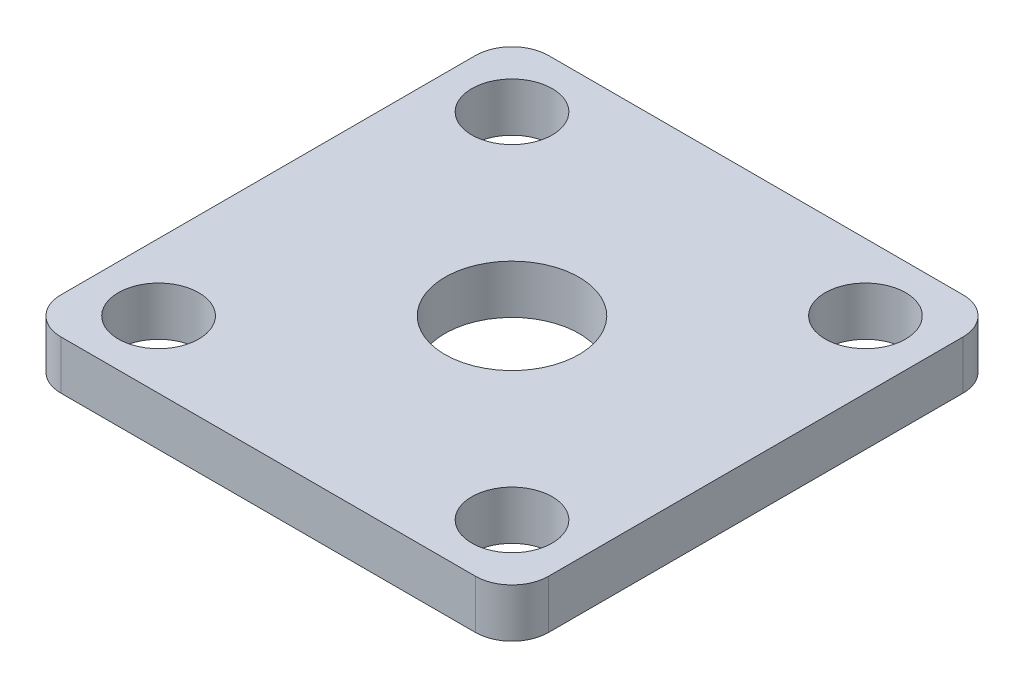
ISO-10303-21;
HEADER;
FILE_DESCRIPTION(('STEP AP214'),'2;1');
FILE_NAME('part.step','',(''),(''),'','','');
FILE_SCHEMA(('AUTOMOTIVE_DESIGN { 1 0 10303 214 1 1 1 1 }'));
ENDSEC;
DATA;
#1=APPLICATION_CONTEXT('core data for automotive mechanical design processes');
#2=APPLICATION_PROTOCOL_DEFINITION('international standard','automotive_design',2000,#1);
#3=PRODUCT_CONTEXT('',#1,'mechanical');
#4=PRODUCT('Part','Part','',(#3));
#5=PRODUCT_RELATED_PRODUCT_CATEGORY('part','',(#4));
#6=PRODUCT_DEFINITION_FORMATION('','',#4);
#7=PRODUCT_DEFINITION_CONTEXT('part definition',#1,'design');
#8=PRODUCT_DEFINITION('design','',#6,#7);
#9=PRODUCT_DEFINITION_SHAPE('','',#8);
#10=(LENGTH_UNIT() NAMED_UNIT(*) SI_UNIT(.MILLI.,.METRE.));
#11=(NAMED_UNIT(*) PLANE_ANGLE_UNIT() SI_UNIT($,.RADIAN.));
#12=(NAMED_UNIT(*) SI_UNIT($,.STERADIAN.) SOLID_ANGLE_UNIT());
#13=UNCERTAINTY_MEASURE_WITH_UNIT(LENGTH_MEASURE(1.E-05),#10,'distance_accuracy_value','');
#14=(GEOMETRIC_REPRESENTATION_CONTEXT(3) GLOBAL_UNCERTAINTY_ASSIGNED_CONTEXT((#13)) GLOBAL_UNIT_ASSIGNED_CONTEXT((#10,
#11,#12)) REPRESENTATION_CONTEXT('',''));
#15=CARTESIAN_POINT('',(0.,0.,0.));
#16=DIRECTION('',(0.,0.,1.));
#17=DIRECTION('',(1.,0.,0.));
#18=AXIS2_PLACEMENT_3D('',#15,#16,#17);
#19=CARTESIAN_POINT('',(20.,4.,20.));
#20=DIRECTION('',(-1.,0.,0.));
#21=DIRECTION('',(0.,0.,1.));
#22=AXIS2_PLACEMENT_3D('',#19,#20,#21);
#23=PLANE('',#22);
#24=DIRECTION('',(0.,0.,-1.));
#25=VECTOR('',#24,1.);
#26=CARTESIAN_POINT('',(20.,0.,20.));
#27=LINE('',#26,#25);
#28=CARTESIAN_POINT('',(20.,0.,17.));
#29=VERTEX_POINT('',#28);
#30=CARTESIAN_POINT('',(20.,0.,-17.));
#31=VERTEX_POINT('',#30);
#32=EDGE_CURVE('E141',#29,#31,#27,.T.);
#33=ORIENTED_EDGE('',*,*,#32,.T.);
#34=DIRECTION('',(0.,-1.,0.));
#35=VECTOR('',#34,1.);
#36=CARTESIAN_POINT('',(20.,4.,-17.));
#37=LINE('',#36,#35);
#38=CARTESIAN_POINT('',(20.,4.,-17.));
#39=VERTEX_POINT('',#38);
#40=EDGE_CURVE('E174',#31,#39,#37,.F.);
#41=ORIENTED_EDGE('',*,*,#40,.T.);
#42=DIRECTION('',(0.,0.,-1.));
#43=VECTOR('',#42,1.);
#44=CARTESIAN_POINT('',(20.,4.,20.));
#45=LINE('',#44,#43);
#46=CARTESIAN_POINT('',(20.,4.,17.));
#47=VERTEX_POINT('',#46);
#48=EDGE_CURVE('E139',#47,#39,#45,.T.);
#49=ORIENTED_EDGE('',*,*,#48,.F.);
#50=DIRECTION('',(0.,-1.,0.));
#51=VECTOR('',#50,1.);
#52=CARTESIAN_POINT('',(20.,4.,17.));
#53=LINE('',#52,#51);
#54=EDGE_CURVE('E170',#47,#29,#53,.T.);
#55=ORIENTED_EDGE('',*,*,#54,.T.);
#56=EDGE_LOOP('',(#33,#41,#49,#55));
#57=FACE_BOUND('',#56,.T.);
#58=ADVANCED_FACE('F38',(#57),#23,.F.);
#59=CARTESIAN_POINT('',(-20.,4.,-20.));
#60=DIRECTION('',(0.,0.,1.));
#61=DIRECTION('',(1.,0.,0.));
#62=AXIS2_PLACEMENT_3D('',#59,#60,#61);
#63=PLANE('',#62);
#64=DIRECTION('',(-1.,0.,0.));
#65=VECTOR('',#64,1.);
#66=CARTESIAN_POINT('',(-20.,0.,-20.));
#67=LINE('',#66,#65);
#68=CARTESIAN_POINT('',(17.,0.,-20.));
#69=VERTEX_POINT('',#68);
#70=CARTESIAN_POINT('',(-17.,0.,-20.));
#71=VERTEX_POINT('',#70);
#72=EDGE_CURVE('E135',#69,#71,#67,.T.);
#73=ORIENTED_EDGE('',*,*,#72,.T.);
#74=DIRECTION('',(0.,-1.,0.));
#75=VECTOR('',#74,1.);
#76=CARTESIAN_POINT('',(-17.,4.,-20.));
#77=LINE('',#76,#75);
#78=CARTESIAN_POINT('',(-17.,4.,-20.));
#79=VERTEX_POINT('',#78);
#80=EDGE_CURVE('E110',#71,#79,#77,.F.);
#81=ORIENTED_EDGE('',*,*,#80,.T.);
#82=DIRECTION('',(-1.,0.,0.));
#83=VECTOR('',#82,1.);
#84=CARTESIAN_POINT('',(-20.,4.,-20.));
#85=LINE('',#84,#83);
#86=CARTESIAN_POINT('',(17.,4.,-20.));
#87=VERTEX_POINT('',#86);
#88=EDGE_CURVE('E181',#87,#79,#85,.T.);
#89=ORIENTED_EDGE('',*,*,#88,.F.);
#90=DIRECTION('',(0.,-1.,0.));
#91=VECTOR('',#90,1.);
#92=CARTESIAN_POINT('',(17.,4.,-20.));
#93=LINE('',#92,#91);
#94=EDGE_CURVE('E116',#87,#69,#93,.T.);
#95=ORIENTED_EDGE('',*,*,#94,.T.);
#96=EDGE_LOOP('',(#73,#81,#89,#95));
#97=FACE_BOUND('',#96,.T.);
#98=ADVANCED_FACE('F271',(#97),#63,.F.);
#99=CARTESIAN_POINT('',(-20.,4.,20.));
#100=DIRECTION('',(1.,0.,0.));
#101=DIRECTION('',(0.,0.,-1.));
#102=AXIS2_PLACEMENT_3D('',#99,#100,#101);
#103=PLANE('',#102);
#104=DIRECTION('',(0.,0.,1.));
#105=VECTOR('',#104,1.);
#106=CARTESIAN_POINT('',(-20.,4.,20.));
#107=LINE('',#106,#105);
#108=CARTESIAN_POINT('',(-20.,4.,-17.));
#109=VERTEX_POINT('',#108);
#110=CARTESIAN_POINT('',(-20.,4.,17.));
#111=VERTEX_POINT('',#110);
#112=EDGE_CURVE('E125',#109,#111,#107,.T.);
#113=ORIENTED_EDGE('',*,*,#112,.F.);
#114=DIRECTION('',(0.,-1.,0.));
#115=VECTOR('',#114,1.);
#116=CARTESIAN_POINT('',(-20.,4.,-17.));
#117=LINE('',#116,#115);
#118=CARTESIAN_POINT('',(-20.,0.,-17.));
#119=VERTEX_POINT('',#118);
#120=EDGE_CURVE('E109',#109,#119,#117,.T.);
#121=ORIENTED_EDGE('',*,*,#120,.T.);
#122=DIRECTION('',(0.,0.,1.));
#123=VECTOR('',#122,1.);
#124=CARTESIAN_POINT('',(-20.,0.,20.));
#125=LINE('',#124,#123);
#126=CARTESIAN_POINT('',(-20.,0.,17.));
#127=VERTEX_POINT('',#126);
#128=EDGE_CURVE('E123',#119,#127,#125,.T.);
#129=ORIENTED_EDGE('',*,*,#128,.T.);
#130=DIRECTION('',(0.,-1.,0.));
#131=VECTOR('',#130,1.);
#132=CARTESIAN_POINT('',(-20.,4.,17.));
#133=LINE('',#132,#131);
#134=EDGE_CURVE('E128',#127,#111,#133,.F.);
#135=ORIENTED_EDGE('',*,*,#134,.T.);
#136=EDGE_LOOP('',(#113,#121,#129,#135));
#137=FACE_BOUND('',#136,.T.);
#138=ADVANCED_FACE('F122',(#137),#103,.F.);
#139=CARTESIAN_POINT('',(-20.,4.,20.));
#140=DIRECTION('',(0.,0.,-1.));
#141=DIRECTION('',(-1.,0.,0.));
#142=AXIS2_PLACEMENT_3D('',#139,#140,#141);
#143=PLANE('',#142);
#144=DIRECTION('',(1.,0.,0.));
#145=VECTOR('',#144,1.);
#146=CARTESIAN_POINT('',(-20.,4.,20.));
#147=LINE('',#146,#145);
#148=CARTESIAN_POINT('',(-17.,4.,20.));
#149=VERTEX_POINT('',#148);
#150=CARTESIAN_POINT('',(17.,4.,20.));
#151=VERTEX_POINT('',#150);
#152=EDGE_CURVE('E146',#149,#151,#147,.T.);
#153=ORIENTED_EDGE('',*,*,#152,.F.);
#154=DIRECTION('',(0.,-1.,0.));
#155=VECTOR('',#154,1.);
#156=CARTESIAN_POINT('',(-17.,4.,20.));
#157=LINE('',#156,#155);
#158=CARTESIAN_POINT('',(-17.,0.,20.));
#159=VERTEX_POINT('',#158);
#160=EDGE_CURVE('E11',#149,#159,#157,.T.);
#161=ORIENTED_EDGE('',*,*,#160,.T.);
#162=DIRECTION('',(1.,0.,0.));
#163=VECTOR('',#162,1.);
#164=CARTESIAN_POINT('',(-20.,0.,20.));
#165=LINE('',#164,#163);
#166=CARTESIAN_POINT('',(17.,0.,20.));
#167=VERTEX_POINT('',#166);
#168=EDGE_CURVE('E134',#159,#167,#165,.T.);
#169=ORIENTED_EDGE('',*,*,#168,.T.);
#170=DIRECTION('',(0.,-1.,0.));
#171=VECTOR('',#170,1.);
#172=CARTESIAN_POINT('',(17.,4.,20.));
#173=LINE('',#172,#171);
#174=EDGE_CURVE('E47',#167,#151,#173,.F.);
#175=ORIENTED_EDGE('',*,*,#174,.T.);
#176=EDGE_LOOP('',(#153,#161,#169,#175));
#177=FACE_BOUND('',#176,.T.);
#178=ADVANCED_FACE('F290',(#177),#143,.F.);
#179=CARTESIAN_POINT('',(0.,4.,0.));
#180=DIRECTION('',(0.,-1.,0.));
#181=DIRECTION('',(0.,0.,-1.));
#182=AXIS2_PLACEMENT_3D('',#179,#180,#181);
#183=PLANE('',#182);
#184=CARTESIAN_POINT('',(14.5,4.,-14.5));
#185=DIRECTION('',(0.,-1.,0.));
#186=DIRECTION('',(0.,0.,-1.));
#187=AXIS2_PLACEMENT_3D('',#184,#185,#186);
#188=CIRCLE('',#187,3.3);
#189=CARTESIAN_POINT('',(14.5,4.,-17.8));
#190=VERTEX_POINT('',#189);
#191=EDGE_CURVE('E232',#190,#190,#188,.T.);
#192=ORIENTED_EDGE('',*,*,#191,.T.);
#193=EDGE_LOOP('',(#192));
#194=FACE_BOUND('',#193,.T.);
#195=CARTESIAN_POINT('',(-14.5,4.,-14.5));
#196=DIRECTION('',(0.,-1.,0.));
#197=DIRECTION('',(0.,0.,-1.));
#198=AXIS2_PLACEMENT_3D('',#195,#196,#197);
#199=CIRCLE('',#198,3.3);
#200=CARTESIAN_POINT('',(-14.5,4.,-17.8));
#201=VERTEX_POINT('',#200);
#202=EDGE_CURVE('E224',#201,#201,#199,.T.);
#203=ORIENTED_EDGE('',*,*,#202,.T.);
#204=EDGE_LOOP('',(#203));
#205=FACE_BOUND('',#204,.T.);
#206=CARTESIAN_POINT('',(14.5,4.,14.5));
#207=DIRECTION('',(0.,-1.,0.));
#208=DIRECTION('',(0.,0.,-1.));
#209=AXIS2_PLACEMENT_3D('',#206,#207,#208);
#210=CIRCLE('',#209,3.3);
#211=CARTESIAN_POINT('',(14.5,4.,11.2));
#212=VERTEX_POINT('',#211);
#213=EDGE_CURVE('E216',#212,#212,#210,.T.);
#214=ORIENTED_EDGE('',*,*,#213,.T.);
#215=EDGE_LOOP('',(#214));
#216=FACE_BOUND('',#215,.T.);
#217=CARTESIAN_POINT('',(-14.5,4.,14.5));
#218=DIRECTION('',(0.,-1.,0.));
#219=DIRECTION('',(0.,0.,-1.));
#220=AXIS2_PLACEMENT_3D('',#217,#218,#219);
#221=CIRCLE('',#220,3.3);
#222=CARTESIAN_POINT('',(-14.5,4.,11.2));
#223=VERTEX_POINT('',#222);
#224=EDGE_CURVE('E205',#223,#223,#221,.T.);
#225=ORIENTED_EDGE('',*,*,#224,.T.);
#226=EDGE_LOOP('',(#225));
#227=FACE_BOUND('',#226,.T.);
#228=CARTESIAN_POINT('',(0.,4.,0.));
#229=DIRECTION('',(0.,1.,0.));
#230=DIRECTION('',(0.,0.,1.));
#231=AXIS2_PLACEMENT_3D('',#228,#229,#230);
#232=CIRCLE('',#231,5.5);
#233=CARTESIAN_POINT('',(0.,4.,5.5));
#234=VERTEX_POINT('',#233);
#235=EDGE_CURVE('E200',#234,#234,#232,.T.);
#236=ORIENTED_EDGE('',*,*,#235,.F.);
#237=EDGE_LOOP('',(#236));
#238=FACE_BOUND('',#237,.T.);
#239=ORIENTED_EDGE('',*,*,#88,.T.);
#240=CARTESIAN_POINT('',(-17.,4.,-17.));
#241=DIRECTION('',(0.,-1.,0.));
#242=DIRECTION('',(0.,0.,-1.));
#243=AXIS2_PLACEMENT_3D('',#240,#241,#242);
#244=CIRCLE('',#243,3.);
#245=EDGE_CURVE('E167',#79,#109,#244,.F.);
#246=ORIENTED_EDGE('',*,*,#245,.T.);
#247=ORIENTED_EDGE('',*,*,#112,.T.);
#248=CARTESIAN_POINT('',(-17.,4.,17.));
#249=DIRECTION('',(0.,-1.,0.));
#250=DIRECTION('',(0.,0.,-1.));
#251=AXIS2_PLACEMENT_3D('',#248,#249,#250);
#252=CIRCLE('',#251,3.);
#253=EDGE_CURVE('E60',#111,#149,#252,.F.);
#254=ORIENTED_EDGE('',*,*,#253,.T.);
#255=ORIENTED_EDGE('',*,*,#152,.T.);
#256=CARTESIAN_POINT('',(17.,4.,17.));
#257=DIRECTION('',(0.,-1.,0.));
#258=DIRECTION('',(0.,0.,-1.));
#259=AXIS2_PLACEMENT_3D('',#256,#257,#258);
#260=CIRCLE('',#259,3.);
#261=EDGE_CURVE('E159',#151,#47,#260,.F.);
#262=ORIENTED_EDGE('',*,*,#261,.T.);
#263=ORIENTED_EDGE('',*,*,#48,.T.);
#264=CARTESIAN_POINT('',(17.,4.,-17.));
#265=DIRECTION('',(0.,-1.,0.));
#266=DIRECTION('',(0.,0.,-1.));
#267=AXIS2_PLACEMENT_3D('',#264,#265,#266);
#268=CIRCLE('',#267,3.);
#269=EDGE_CURVE('E164',#39,#87,#268,.F.);
#270=ORIENTED_EDGE('',*,*,#269,.T.);
#271=EDGE_LOOP('',(#239,#246,#247,#254,#255,#262,#263,#270));
#272=FACE_BOUND('',#271,.T.);
#273=ADVANCED_FACE('F246',(#194,#205,#216,#227,#238,#272),#183,.F.);
#274=CARTESIAN_POINT('',(0.,0.,0.));
#275=DIRECTION('',(0.,-1.,0.));
#276=DIRECTION('',(0.,0.,-1.));
#277=AXIS2_PLACEMENT_3D('',#274,#275,#276);
#278=PLANE('',#277);
#279=CARTESIAN_POINT('',(14.5,0.,-14.5));
#280=DIRECTION('',(0.,-1.,0.));
#281=DIRECTION('',(0.,0.,-1.));
#282=AXIS2_PLACEMENT_3D('',#279,#280,#281);
#283=CIRCLE('',#282,3.3);
#284=CARTESIAN_POINT('',(14.5,0.,-17.8));
#285=VERTEX_POINT('',#284);
#286=EDGE_CURVE('E236',#285,#285,#283,.T.);
#287=ORIENTED_EDGE('',*,*,#286,.F.);
#288=EDGE_LOOP('',(#287));
#289=FACE_BOUND('',#288,.T.);
#290=CARTESIAN_POINT('',(-14.5,0.,-14.5));
#291=DIRECTION('',(0.,-1.,0.));
#292=DIRECTION('',(0.,0.,-1.));
#293=AXIS2_PLACEMENT_3D('',#290,#291,#292);
#294=CIRCLE('',#293,3.3);
#295=CARTESIAN_POINT('',(-14.5,0.,-17.8));
#296=VERTEX_POINT('',#295);
#297=EDGE_CURVE('E228',#296,#296,#294,.T.);
#298=ORIENTED_EDGE('',*,*,#297,.F.);
#299=EDGE_LOOP('',(#298));
#300=FACE_BOUND('',#299,.T.);
#301=CARTESIAN_POINT('',(14.5,0.,14.5));
#302=DIRECTION('',(0.,-1.,0.));
#303=DIRECTION('',(0.,0.,-1.));
#304=AXIS2_PLACEMENT_3D('',#301,#302,#303);
#305=CIRCLE('',#304,3.3);
#306=CARTESIAN_POINT('',(14.5,0.,11.2));
#307=VERTEX_POINT('',#306);
#308=EDGE_CURVE('E220',#307,#307,#305,.T.);
#309=ORIENTED_EDGE('',*,*,#308,.F.);
#310=EDGE_LOOP('',(#309));
#311=FACE_BOUND('',#310,.T.);
#312=CARTESIAN_POINT('',(-14.5,0.,14.5));
#313=DIRECTION('',(0.,-1.,0.));
#314=DIRECTION('',(0.,0.,-1.));
#315=AXIS2_PLACEMENT_3D('',#312,#313,#314);
#316=CIRCLE('',#315,3.3);
#317=CARTESIAN_POINT('',(-14.5,0.,11.2));
#318=VERTEX_POINT('',#317);
#319=EDGE_CURVE('E210',#318,#318,#316,.T.);
#320=ORIENTED_EDGE('',*,*,#319,.F.);
#321=EDGE_LOOP('',(#320));
#322=FACE_BOUND('',#321,.T.);
#323=CARTESIAN_POINT('',(0.,0.,0.));
#324=DIRECTION('',(0.,1.,0.));
#325=DIRECTION('',(0.,0.,1.));
#326=AXIS2_PLACEMENT_3D('',#323,#324,#325);
#327=CIRCLE('',#326,5.5);
#328=CARTESIAN_POINT('',(0.,0.,5.5));
#329=VERTEX_POINT('',#328);
#330=EDGE_CURVE('E191',#329,#329,#327,.T.);
#331=ORIENTED_EDGE('',*,*,#330,.T.);
#332=EDGE_LOOP('',(#331));
#333=FACE_BOUND('',#332,.T.);
#334=ORIENTED_EDGE('',*,*,#128,.F.);
#335=CARTESIAN_POINT('',(-17.,0.,-17.));
#336=DIRECTION('',(0.,-1.,0.));
#337=DIRECTION('',(0.,0.,-1.));
#338=AXIS2_PLACEMENT_3D('',#335,#336,#337);
#339=CIRCLE('',#338,3.);
#340=EDGE_CURVE('E105',#119,#71,#339,.T.);
#341=ORIENTED_EDGE('',*,*,#340,.T.);
#342=ORIENTED_EDGE('',*,*,#72,.F.);
#343=CARTESIAN_POINT('',(17.,0.,-17.));
#344=DIRECTION('',(0.,-1.,0.));
#345=DIRECTION('',(0.,0.,-1.));
#346=AXIS2_PLACEMENT_3D('',#343,#344,#345);
#347=CIRCLE('',#346,3.);
#348=EDGE_CURVE('E117',#69,#31,#347,.T.);
#349=ORIENTED_EDGE('',*,*,#348,.T.);
#350=ORIENTED_EDGE('',*,*,#32,.F.);
#351=CARTESIAN_POINT('',(17.,0.,17.));
#352=DIRECTION('',(0.,-1.,0.));
#353=DIRECTION('',(0.,0.,-1.));
#354=AXIS2_PLACEMENT_3D('',#351,#352,#353);
#355=CIRCLE('',#354,3.);
#356=EDGE_CURVE('E127',#29,#167,#355,.T.);
#357=ORIENTED_EDGE('',*,*,#356,.T.);
#358=ORIENTED_EDGE('',*,*,#168,.F.);
#359=CARTESIAN_POINT('',(-17.,0.,17.));
#360=DIRECTION('',(0.,-1.,0.));
#361=DIRECTION('',(0.,0.,-1.));
#362=AXIS2_PLACEMENT_3D('',#359,#360,#361);
#363=CIRCLE('',#362,3.);
#364=EDGE_CURVE('E132',#159,#127,#363,.T.);
#365=ORIENTED_EDGE('',*,*,#364,.T.);
#366=EDGE_LOOP('',(#334,#341,#342,#349,#350,#357,#358,#365));
#367=FACE_BOUND('',#366,.T.);
#368=ADVANCED_FACE('F130',(#289,#300,#311,#322,#333,#367),#278,.T.);
#369=CARTESIAN_POINT('',(0.,4.,0.));
#370=DIRECTION('',(0.,1.,0.));
#371=DIRECTION('',(0.,0.,1.));
#372=AXIS2_PLACEMENT_3D('',#369,#370,#371);
#373=CYLINDRICAL_SURFACE('',#372,5.5);
#374=ORIENTED_EDGE('',*,*,#330,.F.);
#375=EDGE_LOOP('',(#374));
#376=FACE_BOUND('',#375,.T.);
#377=ORIENTED_EDGE('',*,*,#235,.T.);
#378=EDGE_LOOP('',(#377));
#379=FACE_BOUND('',#378,.T.);
#380=ADVANCED_FACE('F245',(#376,#379),#373,.F.);
#381=CARTESIAN_POINT('',(-17.,4.,-17.));
#382=DIRECTION('',(0.,-1.,0.));
#383=DIRECTION('',(0.,0.,-1.));
#384=AXIS2_PLACEMENT_3D('',#381,#382,#383);
#385=CYLINDRICAL_SURFACE('',#384,3.);
#386=ORIENTED_EDGE('',*,*,#245,.F.);
#387=ORIENTED_EDGE('',*,*,#80,.F.);
#388=ORIENTED_EDGE('',*,*,#340,.F.);
#389=ORIENTED_EDGE('',*,*,#120,.F.);
#390=EDGE_LOOP('',(#386,#387,#388,#389));
#391=FACE_BOUND('',#390,.T.);
#392=ADVANCED_FACE('F108',(#391),#385,.T.);
#393=CARTESIAN_POINT('',(17.,4.,-17.));
#394=DIRECTION('',(0.,-1.,0.));
#395=DIRECTION('',(0.,0.,-1.));
#396=AXIS2_PLACEMENT_3D('',#393,#394,#395);
#397=CYLINDRICAL_SURFACE('',#396,3.);
#398=ORIENTED_EDGE('',*,*,#269,.F.);
#399=ORIENTED_EDGE('',*,*,#40,.F.);
#400=ORIENTED_EDGE('',*,*,#348,.F.);
#401=ORIENTED_EDGE('',*,*,#94,.F.);
#402=EDGE_LOOP('',(#398,#399,#400,#401));
#403=FACE_BOUND('',#402,.T.);
#404=ADVANCED_FACE('F282',(#403),#397,.T.);
#405=CARTESIAN_POINT('',(-17.,4.,17.));
#406=DIRECTION('',(0.,-1.,0.));
#407=DIRECTION('',(0.,0.,-1.));
#408=AXIS2_PLACEMENT_3D('',#405,#406,#407);
#409=CYLINDRICAL_SURFACE('',#408,3.);
#410=ORIENTED_EDGE('',*,*,#253,.F.);
#411=ORIENTED_EDGE('',*,*,#134,.F.);
#412=ORIENTED_EDGE('',*,*,#364,.F.);
#413=ORIENTED_EDGE('',*,*,#160,.F.);
#414=EDGE_LOOP('',(#410,#411,#412,#413));
#415=FACE_BOUND('',#414,.T.);
#416=ADVANCED_FACE('F266',(#415),#409,.T.);
#417=CARTESIAN_POINT('',(17.,4.,17.));
#418=DIRECTION('',(0.,-1.,0.));
#419=DIRECTION('',(0.,0.,-1.));
#420=AXIS2_PLACEMENT_3D('',#417,#418,#419);
#421=CYLINDRICAL_SURFACE('',#420,3.);
#422=ORIENTED_EDGE('',*,*,#261,.F.);
#423=ORIENTED_EDGE('',*,*,#174,.F.);
#424=ORIENTED_EDGE('',*,*,#356,.F.);
#425=ORIENTED_EDGE('',*,*,#54,.F.);
#426=EDGE_LOOP('',(#422,#423,#424,#425));
#427=FACE_BOUND('',#426,.T.);
#428=ADVANCED_FACE('F40',(#427),#421,.T.);
#429=CARTESIAN_POINT('',(-14.5,0.,14.5));
#430=DIRECTION('',(0.,-1.,0.));
#431=DIRECTION('',(0.,0.,-1.));
#432=AXIS2_PLACEMENT_3D('',#429,#430,#431);
#433=CYLINDRICAL_SURFACE('',#432,3.3);
#434=ORIENTED_EDGE('',*,*,#224,.F.);
#435=EDGE_LOOP('',(#434));
#436=FACE_BOUND('',#435,.T.);
#437=ORIENTED_EDGE('',*,*,#319,.T.);
#438=EDGE_LOOP('',(#437));
#439=FACE_BOUND('',#438,.T.);
#440=ADVANCED_FACE('F254',(#436,#439),#433,.F.);
#441=CARTESIAN_POINT('',(14.5,0.,14.5));
#442=DIRECTION('',(0.,-1.,0.));
#443=DIRECTION('',(0.,0.,-1.));
#444=AXIS2_PLACEMENT_3D('',#441,#442,#443);
#445=CYLINDRICAL_SURFACE('',#444,3.3);
#446=ORIENTED_EDGE('',*,*,#213,.F.);
#447=EDGE_LOOP('',(#446));
#448=FACE_BOUND('',#447,.T.);
#449=ORIENTED_EDGE('',*,*,#308,.T.);
#450=EDGE_LOOP('',(#449));
#451=FACE_BOUND('',#450,.T.);
#452=ADVANCED_FACE('F256',(#448,#451),#445,.F.);
#453=CARTESIAN_POINT('',(-14.5,0.,-14.5));
#454=DIRECTION('',(0.,-1.,0.));
#455=DIRECTION('',(0.,0.,-1.));
#456=AXIS2_PLACEMENT_3D('',#453,#454,#455);
#457=CYLINDRICAL_SURFACE('',#456,3.3);
#458=ORIENTED_EDGE('',*,*,#202,.F.);
#459=EDGE_LOOP('',(#458));
#460=FACE_BOUND('',#459,.T.);
#461=ORIENTED_EDGE('',*,*,#297,.T.);
#462=EDGE_LOOP('',(#461));
#463=FACE_BOUND('',#462,.T.);
#464=ADVANCED_FACE('F263',(#460,#463),#457,.F.);
#465=CARTESIAN_POINT('',(14.5,0.,-14.5));
#466=DIRECTION('',(0.,-1.,0.));
#467=DIRECTION('',(0.,0.,-1.));
#468=AXIS2_PLACEMENT_3D('',#465,#466,#467);
#469=CYLINDRICAL_SURFACE('',#468,3.3);
#470=ORIENTED_EDGE('',*,*,#191,.F.);
#471=EDGE_LOOP('',(#470));
#472=FACE_BOUND('',#471,.T.);
#473=ORIENTED_EDGE('',*,*,#286,.T.);
#474=EDGE_LOOP('',(#473));
#475=FACE_BOUND('',#474,.T.);
#476=ADVANCED_FACE('F241',(#472,#475),#469,.F.);
#477=CLOSED_SHELL('',(#58,#98,#138,#178,#273,#368,#380,#392,#404,#416,#428,#440,#452,#464,#476));
#478=MANIFOLD_SOLID_BREP('B2',#477);
#479=ADVANCED_BREP_SHAPE_REPRESENTATION('',(#18,#478),#14);
#480=SHAPE_DEFINITION_REPRESENTATION(#9,#479);
ENDSEC;
END-ISO-10303-21;
